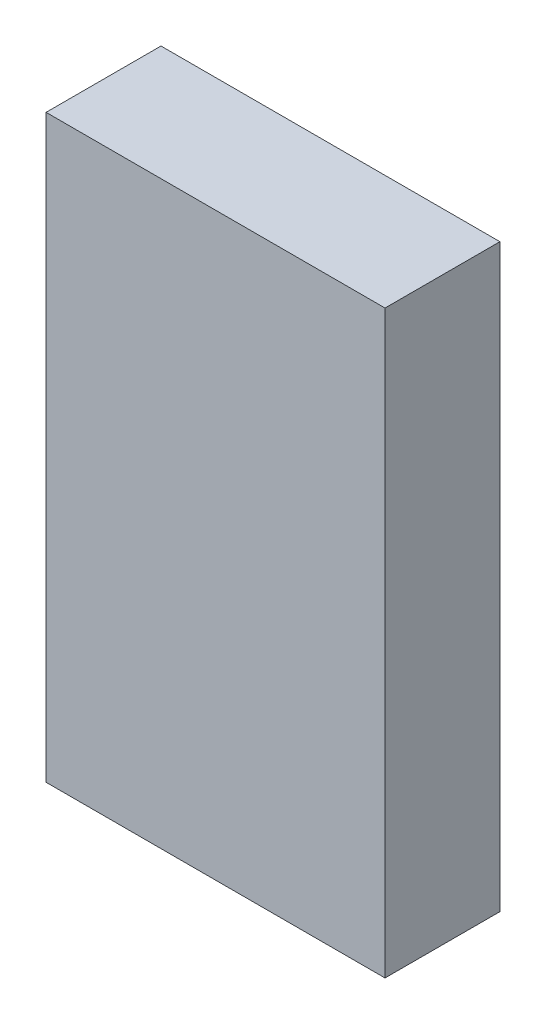
ISO-10303-21;
HEADER;
FILE_DESCRIPTION(('STEP AP214'),'2;1');
FILE_NAME('part.step','',(''),(''),'','','');
FILE_SCHEMA(('AUTOMOTIVE_DESIGN { 1 0 10303 214 1 1 1 1 }'));
ENDSEC;
DATA;
#1=APPLICATION_CONTEXT('core data for automotive mechanical design processes');
#2=APPLICATION_PROTOCOL_DEFINITION('international standard','automotive_design',2000,#1);
#3=PRODUCT_CONTEXT('',#1,'mechanical');
#4=PRODUCT('Part','Part','',(#3));
#5=PRODUCT_RELATED_PRODUCT_CATEGORY('part','',(#4));
#6=PRODUCT_DEFINITION_FORMATION('','',#4);
#7=PRODUCT_DEFINITION_CONTEXT('part definition',#1,'design');
#8=PRODUCT_DEFINITION('design','',#6,#7);
#9=PRODUCT_DEFINITION_SHAPE('','',#8);
#10=(LENGTH_UNIT() NAMED_UNIT(*) SI_UNIT(.MILLI.,.METRE.));
#11=(NAMED_UNIT(*) PLANE_ANGLE_UNIT() SI_UNIT($,.RADIAN.));
#12=(NAMED_UNIT(*) SI_UNIT($,.STERADIAN.) SOLID_ANGLE_UNIT());
#13=UNCERTAINTY_MEASURE_WITH_UNIT(LENGTH_MEASURE(1.E-05),#10,'distance_accuracy_value','');
#14=(GEOMETRIC_REPRESENTATION_CONTEXT(3) GLOBAL_UNCERTAINTY_ASSIGNED_CONTEXT((#13)) GLOBAL_UNIT_ASSIGNED_CONTEXT((#10,
#11,#12)) REPRESENTATION_CONTEXT('',''));
#15=CARTESIAN_POINT('',(0.,0.,0.));
#16=DIRECTION('',(0.,0.,1.));
#17=DIRECTION('',(1.,0.,0.));
#18=AXIS2_PLACEMENT_3D('',#15,#16,#17);
#19=CARTESIAN_POINT('',(-2.94999918,5.05000006,2.));
#20=DIRECTION('',(0.,0.,1.));
#21=DIRECTION('',(1.,0.,0.));
#22=AXIS2_PLACEMENT_3D('',#19,#20,#21);
#23=PLANE('',#22);
#24=DIRECTION('',(0.,1.,0.));
#25=VECTOR('',#24,1.);
#26=CARTESIAN_POINT('',(2.95000172,5.05000006,2.));
#27=LINE('',#26,#25);
#28=CARTESIAN_POINT('',(2.95000172,5.05000006,2.));
#29=VERTEX_POINT('',#28);
#30=CARTESIAN_POINT('',(2.95000172,-5.05000006,2.));
#31=VERTEX_POINT('',#30);
#32=EDGE_CURVE('E53',#29,#31,#27,.F.);
#33=ORIENTED_EDGE('',*,*,#32,.F.);
#34=DIRECTION('',(1.,0.,0.));
#35=VECTOR('',#34,1.);
#36=CARTESIAN_POINT('',(-2.94999918,5.05000006,2.));
#37=LINE('',#36,#35);
#38=CARTESIAN_POINT('',(-2.94999918,5.05000006,2.));
#39=VERTEX_POINT('',#38);
#40=EDGE_CURVE('E68',#39,#29,#37,.T.);
#41=ORIENTED_EDGE('',*,*,#40,.F.);
#42=DIRECTION('',(0.,1.,0.));
#43=VECTOR('',#42,1.);
#44=CARTESIAN_POINT('',(-2.94999918,-5.05000006,2.));
#45=LINE('',#44,#43);
#46=CARTESIAN_POINT('',(-2.94999918,-5.05000006,2.));
#47=VERTEX_POINT('',#46);
#48=EDGE_CURVE('E20',#47,#39,#45,.T.);
#49=ORIENTED_EDGE('',*,*,#48,.F.);
#50=DIRECTION('',(1.,0.,0.));
#51=VECTOR('',#50,1.);
#52=CARTESIAN_POINT('',(2.95000172,-5.05000006,2.));
#53=LINE('',#52,#51);
#54=EDGE_CURVE('E58',#31,#47,#53,.F.);
#55=ORIENTED_EDGE('',*,*,#54,.F.);
#56=EDGE_LOOP('',(#33,#41,#49,#55));
#57=FACE_BOUND('',#56,.T.);
#58=ADVANCED_FACE('F17',(#57),#23,.T.);
#59=CARTESIAN_POINT('',(-2.94999918,-5.05000006,0.));
#60=DIRECTION('',(-1.,0.,0.));
#61=DIRECTION('',(0.,0.,1.));
#62=AXIS2_PLACEMENT_3D('',#59,#60,#61);
#63=PLANE('',#62);
#64=DIRECTION('',(0.,0.,1.));
#65=VECTOR('',#64,1.);
#66=CARTESIAN_POINT('',(-2.94999918,5.05000006,0.));
#67=LINE('',#66,#65);
#68=CARTESIAN_POINT('',(-2.94999918,5.05000006,0.));
#69=VERTEX_POINT('',#68);
#70=EDGE_CURVE('E79',#69,#39,#67,.T.);
#71=ORIENTED_EDGE('',*,*,#70,.F.);
#72=DIRECTION('',(0.,1.,0.));
#73=VECTOR('',#72,1.);
#74=CARTESIAN_POINT('',(-2.94999918,5.05000006,0.));
#75=LINE('',#74,#73);
#76=CARTESIAN_POINT('',(-2.94999918,-5.05000006,0.));
#77=VERTEX_POINT('',#76);
#78=EDGE_CURVE('E74',#69,#77,#75,.F.);
#79=ORIENTED_EDGE('',*,*,#78,.T.);
#80=DIRECTION('',(0.,0.,-1.));
#81=VECTOR('',#80,1.);
#82=CARTESIAN_POINT('',(-2.94999918,-5.05000006,0.));
#83=LINE('',#82,#81);
#84=EDGE_CURVE('E63',#47,#77,#83,.T.);
#85=ORIENTED_EDGE('',*,*,#84,.F.);
#86=ORIENTED_EDGE('',*,*,#48,.T.);
#87=EDGE_LOOP('',(#71,#79,#85,#86));
#88=FACE_BOUND('',#87,.T.);
#89=ADVANCED_FACE('F73',(#88),#63,.T.);
#90=CARTESIAN_POINT('',(2.95000172,-5.05000006,0.));
#91=DIRECTION('',(0.,-1.,0.));
#92=DIRECTION('',(0.,0.,-1.));
#93=AXIS2_PLACEMENT_3D('',#90,#91,#92);
#94=PLANE('',#93);
#95=ORIENTED_EDGE('',*,*,#84,.T.);
#96=DIRECTION('',(1.,0.,0.));
#97=VECTOR('',#96,1.);
#98=CARTESIAN_POINT('',(-2.94999918,-5.05000006,0.));
#99=LINE('',#98,#97);
#100=CARTESIAN_POINT('',(2.95000172,-5.05000006,0.));
#101=VERTEX_POINT('',#100);
#102=EDGE_CURVE('E84',#77,#101,#99,.T.);
#103=ORIENTED_EDGE('',*,*,#102,.T.);
#104=DIRECTION('',(0.,0.,-1.));
#105=VECTOR('',#104,1.);
#106=CARTESIAN_POINT('',(2.95000172,-5.05000006,0.));
#107=LINE('',#106,#105);
#108=EDGE_CURVE('E65',#31,#101,#107,.T.);
#109=ORIENTED_EDGE('',*,*,#108,.F.);
#110=ORIENTED_EDGE('',*,*,#54,.T.);
#111=EDGE_LOOP('',(#95,#103,#109,#110));
#112=FACE_BOUND('',#111,.T.);
#113=ADVANCED_FACE('F60',(#112),#94,.T.);
#114=CARTESIAN_POINT('',(2.95000172,5.05000006,0.));
#115=DIRECTION('',(1.,0.,0.));
#116=DIRECTION('',(0.,0.,-1.));
#117=AXIS2_PLACEMENT_3D('',#114,#115,#116);
#118=PLANE('',#117);
#119=ORIENTED_EDGE('',*,*,#108,.T.);
#120=DIRECTION('',(0.,1.,0.));
#121=VECTOR('',#120,1.);
#122=CARTESIAN_POINT('',(2.95000172,5.05000006,0.));
#123=LINE('',#122,#121);
#124=CARTESIAN_POINT('',(2.95000172,5.05000006,0.));
#125=VERTEX_POINT('',#124);
#126=EDGE_CURVE('E26',#101,#125,#123,.T.);
#127=ORIENTED_EDGE('',*,*,#126,.T.);
#128=DIRECTION('',(0.,0.,1.));
#129=VECTOR('',#128,1.);
#130=CARTESIAN_POINT('',(2.95000172,5.05000006,0.));
#131=LINE('',#130,#129);
#132=EDGE_CURVE('E34',#29,#125,#131,.F.);
#133=ORIENTED_EDGE('',*,*,#132,.F.);
#134=ORIENTED_EDGE('',*,*,#32,.T.);
#135=EDGE_LOOP('',(#119,#127,#133,#134));
#136=FACE_BOUND('',#135,.T.);
#137=ADVANCED_FACE('F88',(#136),#118,.T.);
#138=CARTESIAN_POINT('',(-2.94999918,5.05000006,0.));
#139=DIRECTION('',(0.,1.,0.));
#140=DIRECTION('',(0.,0.,1.));
#141=AXIS2_PLACEMENT_3D('',#138,#139,#140);
#142=PLANE('',#141);
#143=ORIENTED_EDGE('',*,*,#132,.T.);
#144=DIRECTION('',(1.,0.,0.));
#145=VECTOR('',#144,1.);
#146=CARTESIAN_POINT('',(-2.94999918,5.05000006,0.));
#147=LINE('',#146,#145);
#148=EDGE_CURVE('E11',#125,#69,#147,.F.);
#149=ORIENTED_EDGE('',*,*,#148,.T.);
#150=ORIENTED_EDGE('',*,*,#70,.T.);
#151=ORIENTED_EDGE('',*,*,#40,.T.);
#152=EDGE_LOOP('',(#143,#149,#150,#151));
#153=FACE_BOUND('',#152,.T.);
#154=ADVANCED_FACE('F91',(#153),#142,.T.);
#155=CARTESIAN_POINT('',(-2.94999918,5.05000006,0.));
#156=DIRECTION('',(0.,0.,1.));
#157=DIRECTION('',(1.,0.,0.));
#158=AXIS2_PLACEMENT_3D('',#155,#156,#157);
#159=PLANE('',#158);
#160=ORIENTED_EDGE('',*,*,#126,.F.);
#161=ORIENTED_EDGE('',*,*,#102,.F.);
#162=ORIENTED_EDGE('',*,*,#78,.F.);
#163=ORIENTED_EDGE('',*,*,#148,.F.);
#164=EDGE_LOOP('',(#160,#161,#162,#163));
#165=FACE_BOUND('',#164,.T.);
#166=ADVANCED_FACE('F90',(#165),#159,.F.);
#167=CLOSED_SHELL('',(#58,#89,#113,#137,#154,#166));
#168=MANIFOLD_SOLID_BREP('B1',#167);
#169=ADVANCED_BREP_SHAPE_REPRESENTATION('',(#18,#168),#14);
#170=SHAPE_DEFINITION_REPRESENTATION(#9,#169);
ENDSEC;
END-ISO-10303-21;
